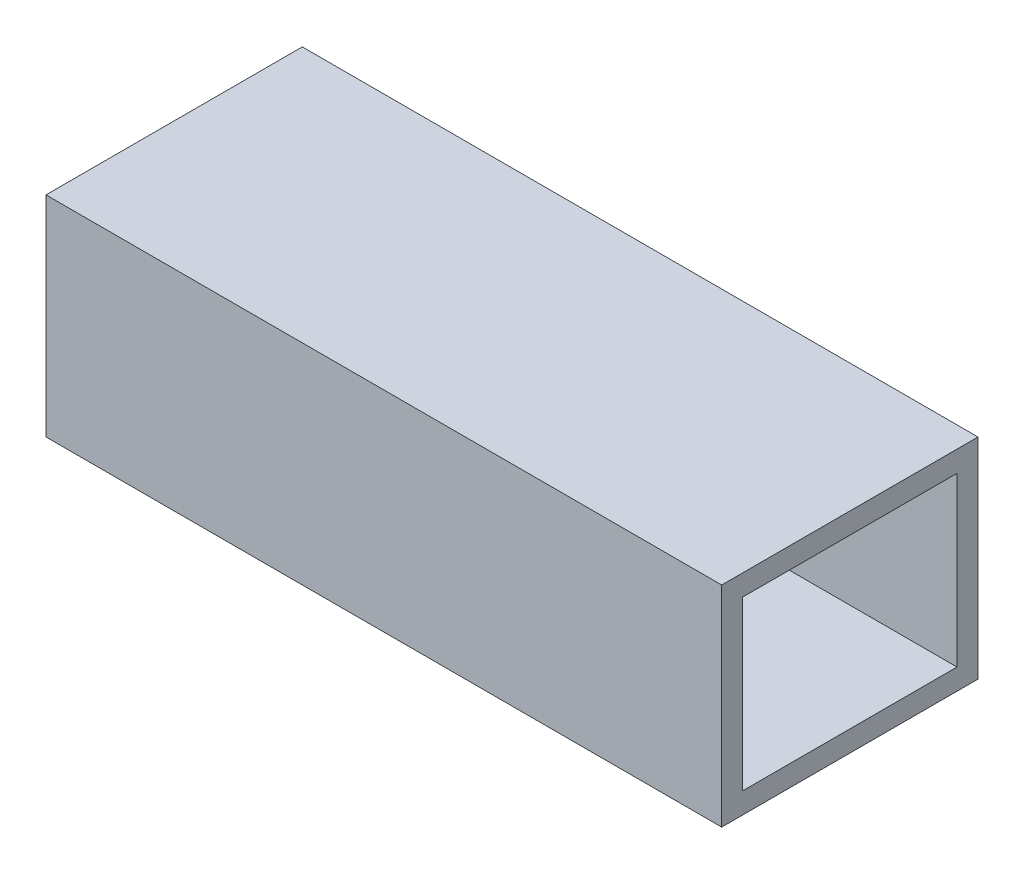
ISO-10303-21;
HEADER;
FILE_DESCRIPTION(('STEP AP214'),'2;1');
FILE_NAME('part.step','',(''),(''),'','','');
FILE_SCHEMA(('AUTOMOTIVE_DESIGN { 1 0 10303 214 1 1 1 1 }'));
ENDSEC;
DATA;
#1=APPLICATION_CONTEXT('core data for automotive mechanical design processes');
#2=APPLICATION_PROTOCOL_DEFINITION('international standard','automotive_design',2000,#1);
#3=PRODUCT_CONTEXT('',#1,'mechanical');
#4=PRODUCT('Part','Part','',(#3));
#5=PRODUCT_RELATED_PRODUCT_CATEGORY('part','',(#4));
#6=PRODUCT_DEFINITION_FORMATION('','',#4);
#7=PRODUCT_DEFINITION_CONTEXT('part definition',#1,'design');
#8=PRODUCT_DEFINITION('design','',#6,#7);
#9=PRODUCT_DEFINITION_SHAPE('','',#8);
#10=(LENGTH_UNIT() NAMED_UNIT(*) SI_UNIT(.MILLI.,.METRE.));
#11=(NAMED_UNIT(*) PLANE_ANGLE_UNIT() SI_UNIT($,.RADIAN.));
#12=(NAMED_UNIT(*) SI_UNIT($,.STERADIAN.) SOLID_ANGLE_UNIT());
#13=UNCERTAINTY_MEASURE_WITH_UNIT(LENGTH_MEASURE(1.E-05),#10,'distance_accuracy_value','');
#14=(GEOMETRIC_REPRESENTATION_CONTEXT(3) GLOBAL_UNCERTAINTY_ASSIGNED_CONTEXT((#13)) GLOBAL_UNIT_ASSIGNED_CONTEXT((#10,
#11,#12)) REPRESENTATION_CONTEXT('',''));
#15=CARTESIAN_POINT('',(0.,0.,0.));
#16=DIRECTION('',(0.,0.,1.));
#17=DIRECTION('',(1.,0.,0.));
#18=AXIS2_PLACEMENT_3D('',#15,#16,#17);
#19=CARTESIAN_POINT('',(0.,0.,55.));
#20=DIRECTION('',(1.,0.,0.));
#21=DIRECTION('',(0.,0.,-1.));
#22=AXIS2_PLACEMENT_3D('',#19,#20,#21);
#23=PLANE('',#22);
#24=DIRECTION('',(0.,-1.,0.));
#25=VECTOR('',#24,1.);
#26=CARTESIAN_POINT('',(0.,0.,0.));
#27=LINE('',#26,#25);
#28=CARTESIAN_POINT('',(0.,45.,0.));
#29=VERTEX_POINT('',#28);
#30=CARTESIAN_POINT('',(0.,0.,0.));
#31=VERTEX_POINT('',#30);
#32=EDGE_CURVE('E151',#29,#31,#27,.T.);
#33=ORIENTED_EDGE('',*,*,#32,.T.);
#34=DIRECTION('',(0.,0.,-1.));
#35=VECTOR('',#34,1.);
#36=CARTESIAN_POINT('',(0.,0.,55.));
#37=LINE('',#36,#35);
#38=CARTESIAN_POINT('',(0.,0.,55.));
#39=VERTEX_POINT('',#38);
#40=EDGE_CURVE('E11',#39,#31,#37,.T.);
#41=ORIENTED_EDGE('',*,*,#40,.F.);
#42=DIRECTION('',(0.,-1.,0.));
#43=VECTOR('',#42,1.);
#44=CARTESIAN_POINT('',(0.,0.,55.));
#45=LINE('',#44,#43);
#46=CARTESIAN_POINT('',(0.,45.,55.));
#47=VERTEX_POINT('',#46);
#48=EDGE_CURVE('E155',#47,#39,#45,.T.);
#49=ORIENTED_EDGE('',*,*,#48,.F.);
#50=DIRECTION('',(0.,0.,-1.));
#51=VECTOR('',#50,1.);
#52=CARTESIAN_POINT('',(0.,45.,55.));
#53=LINE('',#52,#51);
#54=EDGE_CURVE('E161',#47,#29,#53,.T.);
#55=ORIENTED_EDGE('',*,*,#54,.T.);
#56=EDGE_LOOP('',(#33,#41,#49,#55));
#57=FACE_BOUND('',#56,.T.);
#58=ADVANCED_FACE('F43',(#57),#23,.F.);
#59=CARTESIAN_POINT('',(0.,0.,55.));
#60=DIRECTION('',(0.,1.,0.));
#61=DIRECTION('',(0.,0.,1.));
#62=AXIS2_PLACEMENT_3D('',#59,#60,#61);
#63=PLANE('',#62);
#64=DIRECTION('',(1.,0.,0.));
#65=VECTOR('',#64,1.);
#66=CARTESIAN_POINT('',(0.,0.,0.));
#67=LINE('',#66,#65);
#68=CARTESIAN_POINT('',(145.,0.,0.));
#69=VERTEX_POINT('',#68);
#70=EDGE_CURVE('E164',#31,#69,#67,.T.);
#71=ORIENTED_EDGE('',*,*,#70,.T.);
#72=DIRECTION('',(0.,0.,-1.));
#73=VECTOR('',#72,1.);
#74=CARTESIAN_POINT('',(145.,0.,55.));
#75=LINE('',#74,#73);
#76=CARTESIAN_POINT('',(145.,0.,55.));
#77=VERTEX_POINT('',#76);
#78=EDGE_CURVE('E50',#77,#69,#75,.T.);
#79=ORIENTED_EDGE('',*,*,#78,.F.);
#80=DIRECTION('',(1.,0.,0.));
#81=VECTOR('',#80,1.);
#82=CARTESIAN_POINT('',(0.,0.,55.));
#83=LINE('',#82,#81);
#84=EDGE_CURVE('E94',#39,#77,#83,.T.);
#85=ORIENTED_EDGE('',*,*,#84,.F.);
#86=ORIENTED_EDGE('',*,*,#40,.T.);
#87=EDGE_LOOP('',(#71,#79,#85,#86));
#88=FACE_BOUND('',#87,.T.);
#89=ADVANCED_FACE('F193',(#88),#63,.F.);
#90=CARTESIAN_POINT('',(145.,0.,55.));
#91=DIRECTION('',(-1.,0.,0.));
#92=DIRECTION('',(0.,0.,1.));
#93=AXIS2_PLACEMENT_3D('',#90,#91,#92);
#94=PLANE('',#93);
#95=DIRECTION('',(0.,0.,-1.));
#96=VECTOR('',#95,1.);
#97=CARTESIAN_POINT('',(145.,4.49999999999999,50.5));
#98=LINE('',#97,#96);
#99=CARTESIAN_POINT('',(145.,4.49999999999999,50.5));
#100=VERTEX_POINT('',#99);
#101=CARTESIAN_POINT('',(145.,4.49999999999999,4.49999999999999));
#102=VERTEX_POINT('',#101);
#103=EDGE_CURVE('E145',#100,#102,#98,.T.);
#104=ORIENTED_EDGE('',*,*,#103,.F.);
#105=DIRECTION('',(0.,-1.,0.));
#106=VECTOR('',#105,1.);
#107=CARTESIAN_POINT('',(145.,40.5,50.5));
#108=LINE('',#107,#106);
#109=CARTESIAN_POINT('',(145.,40.5,50.5));
#110=VERTEX_POINT('',#109);
#111=EDGE_CURVE('E57',#110,#100,#108,.T.);
#112=ORIENTED_EDGE('',*,*,#111,.F.);
#113=DIRECTION('',(0.,0.,1.));
#114=VECTOR('',#113,1.);
#115=CARTESIAN_POINT('',(145.,40.5,50.5));
#116=LINE('',#115,#114);
#117=CARTESIAN_POINT('',(145.,40.5,4.5));
#118=VERTEX_POINT('',#117);
#119=EDGE_CURVE('E136',#118,#110,#116,.T.);
#120=ORIENTED_EDGE('',*,*,#119,.F.);
#121=DIRECTION('',(0.,1.,0.));
#122=VECTOR('',#121,1.);
#123=CARTESIAN_POINT('',(145.,40.5,4.5));
#124=LINE('',#123,#122);
#125=EDGE_CURVE('E139',#102,#118,#124,.T.);
#126=ORIENTED_EDGE('',*,*,#125,.F.);
#127=EDGE_LOOP('',(#104,#112,#120,#126));
#128=FACE_BOUND('',#127,.T.);
#129=DIRECTION('',(0.,1.,0.));
#130=VECTOR('',#129,1.);
#131=CARTESIAN_POINT('',(145.,0.,0.));
#132=LINE('',#131,#130);
#133=CARTESIAN_POINT('',(145.,45.,0.));
#134=VERTEX_POINT('',#133);
#135=EDGE_CURVE('E166',#69,#134,#132,.T.);
#136=ORIENTED_EDGE('',*,*,#135,.T.);
#137=DIRECTION('',(0.,0.,-1.));
#138=VECTOR('',#137,1.);
#139=CARTESIAN_POINT('',(145.,45.,55.));
#140=LINE('',#139,#138);
#141=CARTESIAN_POINT('',(145.,45.,55.));
#142=VERTEX_POINT('',#141);
#143=EDGE_CURVE('E170',#142,#134,#140,.T.);
#144=ORIENTED_EDGE('',*,*,#143,.F.);
#145=DIRECTION('',(0.,1.,0.));
#146=VECTOR('',#145,1.);
#147=CARTESIAN_POINT('',(145.,0.,55.));
#148=LINE('',#147,#146);
#149=EDGE_CURVE('E158',#77,#142,#148,.T.);
#150=ORIENTED_EDGE('',*,*,#149,.F.);
#151=ORIENTED_EDGE('',*,*,#78,.T.);
#152=EDGE_LOOP('',(#136,#144,#150,#151));
#153=FACE_BOUND('',#152,.T.);
#154=ADVANCED_FACE('F175',(#128,#153),#94,.F.);
#155=CARTESIAN_POINT('',(0.,45.,55.));
#156=DIRECTION('',(0.,-1.,0.));
#157=DIRECTION('',(0.,0.,-1.));
#158=AXIS2_PLACEMENT_3D('',#155,#156,#157);
#159=PLANE('',#158);
#160=DIRECTION('',(-1.,0.,0.));
#161=VECTOR('',#160,1.);
#162=CARTESIAN_POINT('',(0.,45.,0.));
#163=LINE('',#162,#161);
#164=EDGE_CURVE('E87',#134,#29,#163,.T.);
#165=ORIENTED_EDGE('',*,*,#164,.T.);
#166=ORIENTED_EDGE('',*,*,#54,.F.);
#167=DIRECTION('',(-1.,0.,0.));
#168=VECTOR('',#167,1.);
#169=CARTESIAN_POINT('',(0.,45.,55.));
#170=LINE('',#169,#168);
#171=EDGE_CURVE('E66',#142,#47,#170,.T.);
#172=ORIENTED_EDGE('',*,*,#171,.F.);
#173=ORIENTED_EDGE('',*,*,#143,.T.);
#174=EDGE_LOOP('',(#165,#166,#172,#173));
#175=FACE_BOUND('',#174,.T.);
#176=ADVANCED_FACE('F183',(#175),#159,.F.);
#177=CARTESIAN_POINT('',(0.,0.,55.));
#178=DIRECTION('',(0.,0.,-1.));
#179=DIRECTION('',(-1.,0.,0.));
#180=AXIS2_PLACEMENT_3D('',#177,#178,#179);
#181=PLANE('',#180);
#182=ORIENTED_EDGE('',*,*,#48,.T.);
#183=ORIENTED_EDGE('',*,*,#84,.T.);
#184=ORIENTED_EDGE('',*,*,#149,.T.);
#185=ORIENTED_EDGE('',*,*,#171,.T.);
#186=EDGE_LOOP('',(#182,#183,#184,#185));
#187=FACE_BOUND('',#186,.T.);
#188=ADVANCED_FACE('F185',(#187),#181,.F.);
#189=CARTESIAN_POINT('',(0.,0.,0.));
#190=DIRECTION('',(0.,0.,-1.));
#191=DIRECTION('',(-1.,0.,0.));
#192=AXIS2_PLACEMENT_3D('',#189,#190,#191);
#193=PLANE('',#192);
#194=ORIENTED_EDGE('',*,*,#32,.F.);
#195=ORIENTED_EDGE('',*,*,#164,.F.);
#196=ORIENTED_EDGE('',*,*,#135,.F.);
#197=ORIENTED_EDGE('',*,*,#70,.F.);
#198=EDGE_LOOP('',(#194,#195,#196,#197));
#199=FACE_BOUND('',#198,.T.);
#200=ADVANCED_FACE('F179',(#199),#193,.T.);
#201=CARTESIAN_POINT('',(15.,40.5,50.5));
#202=DIRECTION('',(0.,0.,1.));
#203=DIRECTION('',(1.,0.,0.));
#204=AXIS2_PLACEMENT_3D('',#201,#202,#203);
#205=PLANE('',#204);
#206=ORIENTED_EDGE('',*,*,#111,.T.);
#207=DIRECTION('',(1.,0.,0.));
#208=VECTOR('',#207,1.);
#209=CARTESIAN_POINT('',(15.,4.49999999999999,50.5));
#210=LINE('',#209,#208);
#211=CARTESIAN_POINT('',(15.,4.49999999999999,50.5));
#212=VERTEX_POINT('',#211);
#213=EDGE_CURVE('E114',#212,#100,#210,.T.);
#214=ORIENTED_EDGE('',*,*,#213,.F.);
#215=DIRECTION('',(0.,-1.,0.));
#216=VECTOR('',#215,1.);
#217=CARTESIAN_POINT('',(15.,40.5,50.5));
#218=LINE('',#217,#216);
#219=CARTESIAN_POINT('',(15.,40.5,50.5));
#220=VERTEX_POINT('',#219);
#221=EDGE_CURVE('E118',#220,#212,#218,.T.);
#222=ORIENTED_EDGE('',*,*,#221,.F.);
#223=DIRECTION('',(1.,0.,0.));
#224=VECTOR('',#223,1.);
#225=CARTESIAN_POINT('',(15.,40.5,50.5));
#226=LINE('',#225,#224);
#227=EDGE_CURVE('E149',#220,#110,#226,.T.);
#228=ORIENTED_EDGE('',*,*,#227,.T.);
#229=EDGE_LOOP('',(#206,#214,#222,#228));
#230=FACE_BOUND('',#229,.T.);
#231=ADVANCED_FACE('F116',(#230),#205,.F.);
#232=CARTESIAN_POINT('',(15.,40.5,50.5));
#233=DIRECTION('',(0.,1.,0.));
#234=DIRECTION('',(0.,0.,1.));
#235=AXIS2_PLACEMENT_3D('',#232,#233,#234);
#236=PLANE('',#235);
#237=ORIENTED_EDGE('',*,*,#119,.T.);
#238=ORIENTED_EDGE('',*,*,#227,.F.);
#239=DIRECTION('',(0.,0.,1.));
#240=VECTOR('',#239,1.);
#241=CARTESIAN_POINT('',(15.,40.5,50.5));
#242=LINE('',#241,#240);
#243=CARTESIAN_POINT('',(15.,40.5,4.5));
#244=VERTEX_POINT('',#243);
#245=EDGE_CURVE('E124',#244,#220,#242,.T.);
#246=ORIENTED_EDGE('',*,*,#245,.F.);
#247=DIRECTION('',(1.,0.,0.));
#248=VECTOR('',#247,1.);
#249=CARTESIAN_POINT('',(15.,40.5,4.5));
#250=LINE('',#249,#248);
#251=EDGE_CURVE('E152',#244,#118,#250,.T.);
#252=ORIENTED_EDGE('',*,*,#251,.T.);
#253=EDGE_LOOP('',(#237,#238,#246,#252));
#254=FACE_BOUND('',#253,.T.);
#255=ADVANCED_FACE('F238',(#254),#236,.F.);
#256=CARTESIAN_POINT('',(15.,40.5,4.5));
#257=DIRECTION('',(0.,0.,-1.));
#258=DIRECTION('',(0.,1.,0.));
#259=AXIS2_PLACEMENT_3D('',#256,#257,#258);
#260=PLANE('',#259);
#261=ORIENTED_EDGE('',*,*,#125,.T.);
#262=ORIENTED_EDGE('',*,*,#251,.F.);
#263=DIRECTION('',(0.,1.,0.));
#264=VECTOR('',#263,1.);
#265=CARTESIAN_POINT('',(15.,40.5,4.5));
#266=LINE('',#265,#264);
#267=CARTESIAN_POINT('',(15.,4.49999999999999,4.49999999999999));
#268=VERTEX_POINT('',#267);
#269=EDGE_CURVE('E132',#268,#244,#266,.T.);
#270=ORIENTED_EDGE('',*,*,#269,.F.);
#271=DIRECTION('',(1.,0.,0.));
#272=VECTOR('',#271,1.);
#273=CARTESIAN_POINT('',(15.,4.49999999999999,4.49999999999999));
#274=LINE('',#273,#272);
#275=EDGE_CURVE('E123',#268,#102,#274,.T.);
#276=ORIENTED_EDGE('',*,*,#275,.T.);
#277=EDGE_LOOP('',(#261,#262,#270,#276));
#278=FACE_BOUND('',#277,.T.);
#279=ADVANCED_FACE('F247',(#278),#260,.F.);
#280=CARTESIAN_POINT('',(15.,4.49999999999999,50.5));
#281=DIRECTION('',(0.,-1.,0.));
#282=DIRECTION('',(0.,0.,-1.));
#283=AXIS2_PLACEMENT_3D('',#280,#281,#282);
#284=PLANE('',#283);
#285=ORIENTED_EDGE('',*,*,#103,.T.);
#286=ORIENTED_EDGE('',*,*,#275,.F.);
#287=DIRECTION('',(0.,0.,-1.));
#288=VECTOR('',#287,1.);
#289=CARTESIAN_POINT('',(15.,4.49999999999999,50.5));
#290=LINE('',#289,#288);
#291=EDGE_CURVE('E127',#212,#268,#290,.T.);
#292=ORIENTED_EDGE('',*,*,#291,.F.);
#293=ORIENTED_EDGE('',*,*,#213,.T.);
#294=EDGE_LOOP('',(#285,#286,#292,#293));
#295=FACE_BOUND('',#294,.T.);
#296=ADVANCED_FACE('F128',(#295),#284,.F.);
#297=CARTESIAN_POINT('',(15.,0.,0.));
#298=DIRECTION('',(1.,0.,0.));
#299=DIRECTION('',(0.,0.,-1.));
#300=AXIS2_PLACEMENT_3D('',#297,#298,#299);
#301=PLANE('',#300);
#302=ORIENTED_EDGE('',*,*,#221,.T.);
#303=ORIENTED_EDGE('',*,*,#291,.T.);
#304=ORIENTED_EDGE('',*,*,#269,.T.);
#305=ORIENTED_EDGE('',*,*,#245,.T.);
#306=EDGE_LOOP('',(#302,#303,#304,#305));
#307=FACE_BOUND('',#306,.T.);
#308=ADVANCED_FACE('F134',(#307),#301,.T.);
#309=CLOSED_SHELL('',(#58,#89,#154,#176,#188,#200,#231,#255,#279,#296,#308));
#310=MANIFOLD_SOLID_BREP('B2',#309);
#311=ADVANCED_BREP_SHAPE_REPRESENTATION('',(#18,#310),#14);
#312=SHAPE_DEFINITION_REPRESENTATION(#9,#311);
ENDSEC;
END-ISO-10303-21;
